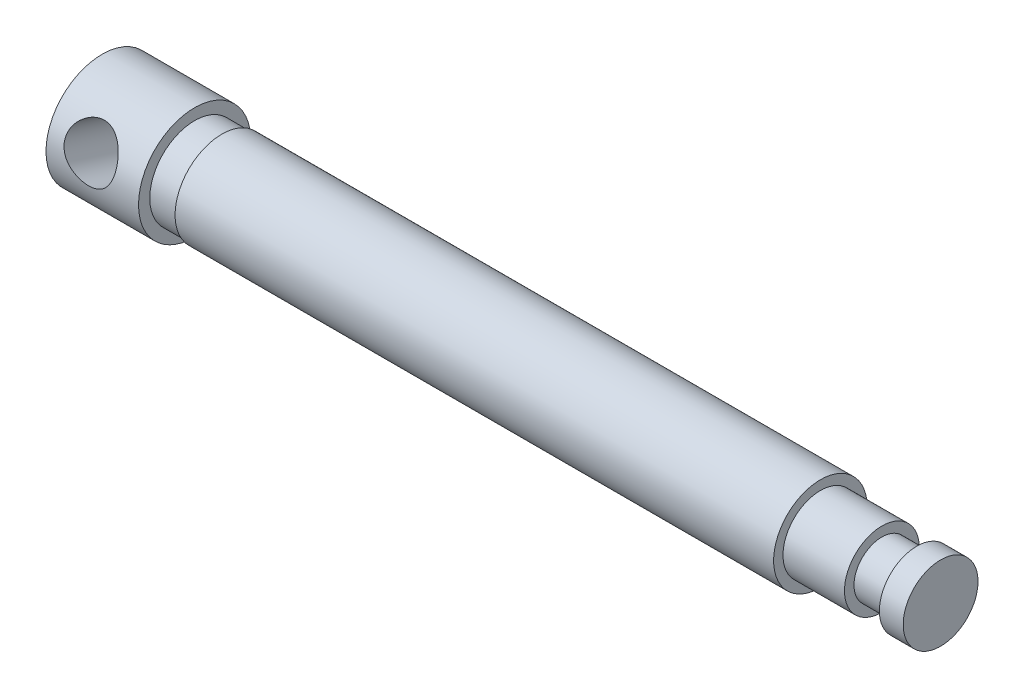
ISO-10303-21;
HEADER;
FILE_DESCRIPTION(('STEP AP214'),'2;1');
FILE_NAME('part.step','',(''),(''),'','','');
FILE_SCHEMA(('AUTOMOTIVE_DESIGN { 1 0 10303 214 1 1 1 1 }'));
ENDSEC;
DATA;
#1=APPLICATION_CONTEXT('core data for automotive mechanical design processes');
#2=APPLICATION_PROTOCOL_DEFINITION('international standard','automotive_design',2000,#1);
#3=PRODUCT_CONTEXT('',#1,'mechanical');
#4=PRODUCT('Part','Part','',(#3));
#5=PRODUCT_RELATED_PRODUCT_CATEGORY('part','',(#4));
#6=PRODUCT_DEFINITION_FORMATION('','',#4);
#7=PRODUCT_DEFINITION_CONTEXT('part definition',#1,'design');
#8=PRODUCT_DEFINITION('design','',#6,#7);
#9=PRODUCT_DEFINITION_SHAPE('','',#8);
#10=(LENGTH_UNIT() NAMED_UNIT(*) SI_UNIT(.MILLI.,.METRE.));
#11=(NAMED_UNIT(*) PLANE_ANGLE_UNIT() SI_UNIT($,.RADIAN.));
#12=(NAMED_UNIT(*) SI_UNIT($,.STERADIAN.) SOLID_ANGLE_UNIT());
#13=UNCERTAINTY_MEASURE_WITH_UNIT(LENGTH_MEASURE(1.E-05),#10,'distance_accuracy_value','');
#14=(GEOMETRIC_REPRESENTATION_CONTEXT(3) GLOBAL_UNCERTAINTY_ASSIGNED_CONTEXT((#13)) GLOBAL_UNIT_ASSIGNED_CONTEXT((#10,
#11,#12)) REPRESENTATION_CONTEXT('',''));
#15=CARTESIAN_POINT('',(0.,0.,0.));
#16=DIRECTION('',(0.,0.,1.));
#17=DIRECTION('',(1.,0.,0.));
#18=AXIS2_PLACEMENT_3D('',#15,#16,#17);
#19=CARTESIAN_POINT('',(0.,-9.525,0.));
#20=DIRECTION('',(-1.,0.,0.));
#21=DIRECTION('',(0.,0.,1.));
#22=AXIS2_PLACEMENT_3D('',#19,#20,#21);
#23=PLANE('',#22);
#24=CARTESIAN_POINT('',(0.,0.,0.));
#25=DIRECTION('',(-1.,0.,0.));
#26=DIRECTION('',(0.,0.,1.));
#27=AXIS2_PLACEMENT_3D('',#24,#25,#26);
#28=CIRCLE('',#27,9.525);
#29=CARTESIAN_POINT('',(0.,0.,9.525));
#30=VERTEX_POINT('',#29);
#31=EDGE_CURVE('E121',#30,#30,#28,.T.);
#32=ORIENTED_EDGE('',*,*,#31,.T.);
#33=EDGE_LOOP('',(#32));
#34=FACE_BOUND('',#33,.T.);
#35=ADVANCED_FACE('F34',(#34),#23,.T.);
#36=CARTESIAN_POINT('',(158.75,0.,0.));
#37=DIRECTION('',(-1.,0.,0.));
#38=DIRECTION('',(0.,0.,1.));
#39=AXIS2_PLACEMENT_3D('',#36,#37,#38);
#40=CYLINDRICAL_SURFACE('',#39,7.62);
#41=CARTESIAN_POINT('',(20.32,0.,0.));
#42=DIRECTION('',(1.,0.,0.));
#43=DIRECTION('',(0.,0.,-1.));
#44=AXIS2_PLACEMENT_3D('',#41,#42,#43);
#45=CIRCLE('',#44,7.62);
#46=CARTESIAN_POINT('',(20.32,0.,-7.62));
#47=VERTEX_POINT('',#46);
#48=EDGE_CURVE('E123',#47,#47,#45,.F.);
#49=ORIENTED_EDGE('',*,*,#48,.T.);
#50=EDGE_LOOP('',(#49));
#51=FACE_BOUND('',#50,.T.);
#52=CARTESIAN_POINT('',(15.706148476498,0.,0.));
#53=DIRECTION('',(-1.,0.,0.));
#54=DIRECTION('',(0.,0.,1.));
#55=AXIS2_PLACEMENT_3D('',#52,#53,#54);
#56=CIRCLE('',#55,7.62);
#57=CARTESIAN_POINT('',(15.706148476498,0.,7.62));
#58=VERTEX_POINT('',#57);
#59=EDGE_CURVE('E49',#58,#58,#56,.T.);
#60=ORIENTED_EDGE('',*,*,#59,.F.);
#61=EDGE_LOOP('',(#60));
#62=FACE_BOUND('',#61,.T.);
#63=ADVANCED_FACE('F113',(#51,#62),#40,.T.);
#64=CARTESIAN_POINT('',(15.706148476498,-7.62,0.));
#65=DIRECTION('',(1.,0.,0.));
#66=DIRECTION('',(0.,0.,-1.));
#67=AXIS2_PLACEMENT_3D('',#64,#65,#66);
#68=PLANE('',#67);
#69=ORIENTED_EDGE('',*,*,#59,.T.);
#70=EDGE_LOOP('',(#69));
#71=FACE_BOUND('',#70,.T.);
#72=CARTESIAN_POINT('',(15.706148476498,0.,0.));
#73=DIRECTION('',(-1.,0.,0.));
#74=DIRECTION('',(0.,0.,1.));
#75=AXIS2_PLACEMENT_3D('',#72,#73,#74);
#76=CIRCLE('',#75,9.525);
#77=CARTESIAN_POINT('',(15.706148476498,0.,9.525));
#78=VERTEX_POINT('',#77);
#79=EDGE_CURVE('E54',#78,#78,#76,.T.);
#80=ORIENTED_EDGE('',*,*,#79,.F.);
#81=EDGE_LOOP('',(#80));
#82=FACE_BOUND('',#81,.T.);
#83=ADVANCED_FACE('F108',(#71,#82),#68,.T.);
#84=CARTESIAN_POINT('',(158.75,0.,0.));
#85=DIRECTION('',(-1.,0.,0.));
#86=DIRECTION('',(0.,0.,1.));
#87=AXIS2_PLACEMENT_3D('',#84,#85,#86);
#88=CYLINDRICAL_SURFACE('',#87,9.525);
#89=CARTESIAN_POINT('',(10.3607599364025,0.,9.525));
#90=CARTESIAN_POINT('',(10.5191364986908,0.185736951544377,9.52499527010194));
#91=CARTESIAN_POINT('',(10.6634881100256,0.383787656188102,9.51953580729828));
#92=CARTESIAN_POINT('',(10.9202225751908,0.799140493333997,9.49370118995498));
#93=CARTESIAN_POINT('',(11.0325536247621,1.01647308453263,9.47330205349973));
#94=CARTESIAN_POINT('',(11.2215270013399,1.46476695610562,9.41441744343158));
#95=CARTESIAN_POINT('',(11.2980627242603,1.69576666685899,9.37587862224707));
#96=CARTESIAN_POINT('',(11.4115485665691,2.16320031195492,9.27917093731359));
#97=CARTESIAN_POINT('',(11.4485341294286,2.39962918641392,9.22101971110659));
#98=CARTESIAN_POINT('',(11.4802078036525,2.85563018773093,9.08976839361644));
#99=CARTESIAN_POINT('',(11.4773167636023,3.07535761858014,9.01778394650828));
#100=CARTESIAN_POINT('',(11.4352207425021,3.50589844064426,8.85928428868552));
#101=CARTESIAN_POINT('',(11.3960152774546,3.7167117130124,8.77276888431538));
#102=CARTESIAN_POINT('',(11.2844340807387,4.11865214927032,8.59126292997238));
#103=CARTESIAN_POINT('',(11.2129143037224,4.31014027802157,8.49653913071002));
#104=CARTESIAN_POINT('',(11.0395618250778,4.67548040898246,8.30111311277807));
#105=CARTESIAN_POINT('',(10.9377226644698,4.84932864274974,8.20040962391017));
#106=CARTESIAN_POINT('',(10.6992368440798,5.18730830605299,7.99121078306556));
#107=CARTESIAN_POINT('',(10.5607814643836,5.35010845793332,7.88262880644303));
#108=CARTESIAN_POINT('',(10.2563155827699,5.65096347171958,7.66982812102441));
#109=CARTESIAN_POINT('',(10.0902885329931,5.78900336898937,7.56561207988273));
#110=CARTESIAN_POINT('',(9.72013932054723,6.04858542153344,7.3600082424051));
#111=CARTESIAN_POINT('',(9.51407113644799,6.16804760202666,7.25945172488597));
#112=CARTESIAN_POINT('',(9.18749689916968,6.32312987387547,7.12379058785145));
#113=CARTESIAN_POINT('',(9.07566311958638,6.370824279271,7.08108060158332));
#114=CARTESIAN_POINT('',(8.84678982973563,6.45797729281414,7.00168724534438));
#115=CARTESIAN_POINT('',(8.72975298153788,6.4974400550423,6.96500083758743));
#116=CARTESIAN_POINT('',(8.49396945610535,6.56709705081749,6.89935530396093));
#117=CARTESIAN_POINT('',(8.375323164339,6.59748268601121,6.87023858605383));
#118=CARTESIAN_POINT('',(8.13469897285254,6.64995794812896,6.81945887772287));
#119=CARTESIAN_POINT('',(8.01272275092659,6.67205167311785,6.79779220574905));
#120=CARTESIAN_POINT('',(7.76645821764584,6.70777105149872,6.76254864007625));
#121=CARTESIAN_POINT('',(7.64217140486392,6.72140200890581,6.7489666795283));
#122=CARTESIAN_POINT('',(7.39232504837467,6.74009197359256,6.73030183794226));
#123=CARTESIAN_POINT('',(7.26676563911811,6.74515187710671,6.72521806828936));
#124=CARTESIAN_POINT('',(7.02864799120306,6.74657598364014,6.72378860685507));
#125=CARTESIAN_POINT('',(6.9160983118217,6.74379134142682,6.72658760370679));
#126=CARTESIAN_POINT('',(6.69172764090169,6.73132919250598,6.73905855982816));
#127=CARTESIAN_POINT('',(6.57990689642615,6.7216494600829,6.74873273838461));
#128=CARTESIAN_POINT('',(6.35787527351533,6.6954678926085,6.77470846361995));
#129=CARTESIAN_POINT('',(6.24766396995085,6.67896789413751,6.79100822612341));
#130=CARTESIAN_POINT('',(6.02955518690167,6.63926321491362,6.82982949123942));
#131=CARTESIAN_POINT('',(5.92165862849644,6.61605591647676,6.85235342283169));
#132=CARTESIAN_POINT('',(5.60529694478747,6.5372637026666,6.92785030356844));
#133=CARTESIAN_POINT('',(5.40105990538804,6.47213850481868,6.98913434112505));
#134=CARTESIAN_POINT('',(5.00860463362805,6.31749342333822,7.12921595534312));
#135=CARTESIAN_POINT('',(4.82039213610284,6.22796485402805,7.20801976581874));
#136=CARTESIAN_POINT('',(4.44545373734529,6.01564457452885,7.3863865544388));
#137=CARTESIAN_POINT('',(4.26069740500449,5.89044626800522,7.48722933588467));
#138=CARTESIAN_POINT('',(3.91775821227732,5.6131559735438,7.69729026126686));
#139=CARTESIAN_POINT('',(3.75958849732245,5.46105075764552,7.80651250968683));
#140=CARTESIAN_POINT('',(3.54075166246218,5.2090919882868,7.97509277438609));
#141=CARTESIAN_POINT('',(3.46912376316846,5.11814829209079,8.03383651109911));
#142=CARTESIAN_POINT('',(3.33499351547364,4.9295428118569,8.15092185901507));
#143=CARTESIAN_POINT('',(3.2724874803552,4.83188376552255,8.20926362354576));
#144=CARTESIAN_POINT('',(3.15715203819268,4.63027063224375,8.32464499366092));
#145=CARTESIAN_POINT('',(3.10432341580406,4.52631603575751,8.38168449332836));
#146=CARTESIAN_POINT('',(3.00891522833457,4.31273662979614,8.49355322312598));
#147=CARTESIAN_POINT('',(2.96633030805965,4.20311481959882,8.54838359560559));
#148=CARTESIAN_POINT('',(2.89388879110688,3.98494179912969,8.65214760559187));
#149=CARTESIAN_POINT('',(2.86346857232699,3.87665305715597,8.70123977979387));
#150=CARTESIAN_POINT('',(2.81257571525813,3.65638757911034,8.79606854974607));
#151=CARTESIAN_POINT('',(2.79209842516826,3.54441259388205,8.84180670615427));
#152=CARTESIAN_POINT('',(2.76132811337706,3.31760479541081,8.92938395063869));
#153=CARTESIAN_POINT('',(2.75103263409749,3.2027726786555,8.97122397739482));
#154=CARTESIAN_POINT('',(2.74075071445813,2.97116784353084,9.05056723293867));
#155=CARTESIAN_POINT('',(2.74076368568873,2.85439523630576,9.08807070913584));
#156=CARTESIAN_POINT('',(2.75069362394716,2.62903273687757,9.15568458758891));
#157=CARTESIAN_POINT('',(2.75984063654251,2.52051237554944,9.18614306531362));
#158=CARTESIAN_POINT('',(2.78680204263107,2.30343925505238,9.24296409341107));
#159=CARTESIAN_POINT('',(2.80461926558988,2.19488649687649,9.26932530295959));
#160=CARTESIAN_POINT('',(2.84873064078999,1.97861549685798,9.31788484591951));
#161=CARTESIAN_POINT('',(2.87502175458566,1.87089697004438,9.34008466695582));
#162=CARTESIAN_POINT('',(2.93581624080212,1.65700962673866,9.38039543016257));
#163=CARTESIAN_POINT('',(2.97032275451687,1.55084141955794,9.39850480310834));
#164=CARTESIAN_POINT('',(3.08624217763544,1.23435876467868,9.44709361989633));
#165=CARTESIAN_POINT('',(3.17977890176946,1.0274079451661,9.47153881017203));
#166=CARTESIAN_POINT('',(3.39595107460002,0.628187770902369,9.50638264949276));
#167=CARTESIAN_POINT('',(3.51859625042481,0.435923352334654,9.51677659526302));
#168=CARTESIAN_POINT('',(3.80087116182484,0.0557674020491262,9.52688250617847));
#169=CARTESIAN_POINT('',(3.96268119367101,-0.130530670377653,9.52566878412402));
#170=CARTESIAN_POINT('',(4.31326259804997,-0.475832360298347,9.51467848072312));
#171=CARTESIAN_POINT('',(4.5020499721636,-0.634819654298398,9.50489679951021));
#172=CARTESIAN_POINT('',(4.80778241025368,-0.852624073065118,9.48706331233395));
#173=CARTESIAN_POINT('',(4.91654042675479,-0.923283941067487,9.48037687426898));
#174=CARTESIAN_POINT('',(5.13981388642196,-1.05475657697705,9.46665074788829));
#175=CARTESIAN_POINT('',(5.25432682873485,-1.1155735745193,9.45961121301638));
#176=CARTESIAN_POINT('',(5.48839116359502,-1.22658872941779,9.44585825394908));
#177=CARTESIAN_POINT('',(5.60794184910525,-1.2767883709851,9.43914478427393));
#178=CARTESIAN_POINT('',(5.85119400439354,-1.36581816062955,9.42667432655738));
#179=CARTESIAN_POINT('',(5.97489309769903,-1.40465469827367,9.4209168017712));
#180=CARTESIAN_POINT('',(6.21743073454272,-1.46822260990757,9.41121214018112));
#181=CARTESIAN_POINT('',(6.33606991971395,-1.49370075498979,9.40717235542773));
#182=CARTESIAN_POINT('',(6.57517016061681,-1.53373513987291,9.40072842877159));
#183=CARTESIAN_POINT('',(6.69563029767528,-1.5482967110718,9.39832348850282));
#184=CARTESIAN_POINT('',(6.93735791982056,-1.56625785162575,9.3953469852333));
#185=CARTESIAN_POINT('',(7.0586250777104,-1.56966169776488,9.39477471976563));
#186=CARTESIAN_POINT('',(7.30094385470936,-1.56525839021776,9.3955093666478));
#187=CARTESIAN_POINT('',(7.4219954861345,-1.55745189915842,9.39681616792871));
#188=CARTESIAN_POINT('',(7.65182737236076,-1.53198764075611,9.40099927297783));
#189=CARTESIAN_POINT('',(7.76071831492668,-1.51529510092216,9.40372127046903));
#190=CARTESIAN_POINT('',(7.97673031448197,-1.47301655522465,9.41043545904468));
#191=CARTESIAN_POINT('',(8.08385078188616,-1.44742764689547,9.41442806463262));
#192=CARTESIAN_POINT('',(8.40156224599921,-1.35776206418409,9.42792837579802));
#193=CARTESIAN_POINT('',(8.60857901237537,-1.28077786509333,9.43896026326298));
#194=CARTESIAN_POINT('',(9.01520010929574,-1.09268276574515,9.46260557143946));
#195=CARTESIAN_POINT('',(9.21427417920468,-0.980449343374874,9.47526145697541));
#196=CARTESIAN_POINT('',(9.59305114459453,-0.727237181014353,9.49804365709395));
#197=CARTESIAN_POINT('',(9.77277976218093,-0.58629734969924,9.50817335476516));
#198=CARTESIAN_POINT('',(10.0156916730228,-0.365526097252751,9.5182250512842));
#199=CARTESIAN_POINT('',(10.0879161903266,-0.29551415400242,9.52068852964737));
#200=CARTESIAN_POINT('',(10.2278084293631,-0.151032525435843,9.52407705226857));
#201=CARTESIAN_POINT('',(10.2954757156259,-0.0765624153965945,9.52500194970585));
#202=CARTESIAN_POINT('',(10.3607599364025,0.,9.525));
#203=B_SPLINE_CURVE_WITH_KNOTS('',3,(#89,#90,#91,#92,#93,#94,#95,#96,#97,#98,#99,#100,#101,#102,
#103,#104,#105,#106,#107,#108,#109,#110,#111,#112,#113,#114,#115,#116,#117,#118,#119,#120,#121,
#122,#123,#124,#125,#126,#127,#128,#129,#130,#131,#132,#133,#134,#135,#136,#137,#138,#139,#140,
#141,#142,#143,#144,#145,#146,#147,#148,#149,#150,#151,#152,#153,#154,#155,#156,#157,#158,#159,
#160,#161,#162,#163,#164,#165,#166,#167,#168,#169,#170,#171,#172,#173,#174,#175,#176,#177,#178,
#179,#180,#181,#182,#183,#184,#185,#186,#187,#188,#189,#190,#191,#192,#193,#194,#195,#196,#197,
#198,#199,#200,#201,#202),.UNSPECIFIED.,.T.,.F.,(4,2,2,2,2,2,2,2,2,2,2,2,2,2,2,2,2,2,2,2,2,2,2,
2,2,2,2,2,2,2,2,2,2,2,2,2,2,2,2,2,2,2,2,2,2,2,2,2,2,2,2,2,2,2,2,2,4),(0.,0.73193177901628,
1.46504107421226,2.20031999516466,2.93493943120138,3.62516820512768,4.31540617853331,
4.98834508710979,5.66142745548398,6.37753064123816,7.09406517871376,7.86560591777974,
8.25178454097482,8.63776780596099,9.01491996803209,9.39188548604923,9.76861450287889,
10.1453041245078,10.4827426192057,10.8202900874805,11.1577467191816,11.495335229644,
12.161188939618,12.827279951209,13.5589300325332,14.2909408120148,14.6799733639347,
15.068848245349,15.4577546432318,15.8464572849317,16.2141474914849,16.5816655079629,
16.9490947951478,17.3165031093544,17.6553513485566,17.994310242867,18.333147733142,
18.6721149922002,19.3542030831227,20.0365194281369,20.7736756599335,21.511270964197,
21.9004592632429,22.2894798753917,22.6784460699549,23.0671931234156,23.4309275948773,
23.7944843110461,24.1579016587066,24.5212975261745,24.851491714948,25.1817937317672,
25.842171865918,26.5261788965328,27.2092649206581,27.510944891858,27.812653649545),.UNSPECIFIED.);
#204=CARTESIAN_POINT('',(10.3607599364025,0.,9.525));
#205=VERTEX_POINT('',#204);
#206=EDGE_CURVE('E10',#205,#205,#203,.T.);
#207=ORIENTED_EDGE('',*,*,#206,.F.);
#208=EDGE_LOOP('',(#207));
#209=FACE_BOUND('',#208,.T.);
#210=CARTESIAN_POINT('',(7.10830419949795,-6.74600128240359,-6.72436552381034));
#211=CARTESIAN_POINT('',(6.99308600795315,-6.74600070795134,-6.72436684785682));
#212=CARTESIAN_POINT('',(6.87784106913534,-6.74237477274111,-6.72800982841945));
#213=CARTESIAN_POINT('',(6.64821383569747,-6.7278965239951,-6.74248723719467));
#214=CARTESIAN_POINT('',(6.53383206487401,-6.71704013152422,-6.75332572461471));
#215=CARTESIAN_POINT('',(6.30662870419325,-6.68815232252926,-6.78193619656994));
#216=CARTESIAN_POINT('',(6.19381044601065,-6.67010747589703,-6.79972115790202));
#217=CARTESIAN_POINT('',(5.97074000652934,-6.62697491101131,-6.84176336513133));
#218=CARTESIAN_POINT('',(5.86048894203736,-6.60188418736433,-6.86602337271698));
#219=CARTESIAN_POINT('',(5.53580408849797,-6.51654812716209,-6.9474054047063));
#220=CARTESIAN_POINT('',(5.32611495042217,-6.44606933524494,-7.01330637609985));
#221=CARTESIAN_POINT('',(4.92451021614179,-6.27918589943418,-7.16309582004389));
#222=CARTESIAN_POINT('',(4.73259298167152,-6.18278364844511,-7.24698263223904));
#223=CARTESIAN_POINT('',(4.35722933376751,-5.9577553194022,-7.43327305836452));
#224=CARTESIAN_POINT('',(4.17527246261756,-5.82736946938708,-7.53655321907915));
#225=CARTESIAN_POINT('',(3.83887080016364,-5.53957685783265,-7.75053385176756));
#226=CARTESIAN_POINT('',(3.68443800008382,-5.38215837752827,-7.86123752912963));
#227=CARTESIAN_POINT('',(3.47261664670678,-5.12270253942803,-8.0308823023998));
#228=CARTESIAN_POINT('',(3.40383557588988,-5.02960939758582,-8.08958452798839));
#229=CARTESIAN_POINT('',(3.27557303727922,-4.83683763002201,-8.2062960273234));
#230=CARTESIAN_POINT('',(3.21608769516181,-4.73716177265468,-8.2643055804048));
#231=CARTESIAN_POINT('',(3.10696703107483,-4.53168832184975,-8.3787385503364));
#232=CARTESIAN_POINT('',(3.05733211091934,-4.42589047891408,-8.43516190240244));
#233=CARTESIAN_POINT('',(2.96846787592103,-4.2088400336867,-8.54553092759587));
#234=CARTESIAN_POINT('',(2.92923305850244,-4.09759035296811,-8.59947789840516));
#235=CARTESIAN_POINT('',(2.86367609540549,-3.87729583757032,-8.70091944096472));
#236=CARTESIAN_POINT('',(2.83671218017715,-3.76853059232902,-8.74860687095307));
#237=CARTESIAN_POINT('',(2.79267112231556,-3.5476304250861,-8.84048884127096));
#238=CARTESIAN_POINT('',(2.7755893721607,-3.4354970991344,-8.88468500107885));
#239=CARTESIAN_POINT('',(2.75150822071768,-3.20869996277899,-8.96908618063951));
#240=CARTESIAN_POINT('',(2.74450673185222,-3.09403668131341,-9.00929202516255));
#241=CARTESIAN_POINT('',(2.74066944430504,-2.86310099538295,-9.08532072839287));
#242=CARTESIAN_POINT('',(2.74383314791965,-2.7468286699769,-9.12114380159833));
#243=CARTESIAN_POINT('',(2.75967656254285,-2.52226071764074,-9.18566575338383));
#244=CARTESIAN_POINT('',(2.77163810244702,-2.41400844868048,-9.21469504189839));
#245=CARTESIAN_POINT('',(2.80412095457292,-2.19773163796138,-9.26865837071368));
#246=CARTESIAN_POINT('',(2.82464506247659,-2.08970718217188,-9.29359106976701));
#247=CARTESIAN_POINT('',(2.87403772202958,-1.87473504756537,-9.33932866431435));
#248=CARTESIAN_POINT('',(2.90290347653087,-1.76778702021649,-9.36013493955693));
#249=CARTESIAN_POINT('',(2.96869935057316,-1.55566500290207,-9.39772119251539));
#250=CARTESIAN_POINT('',(3.0056325581491,-1.45049170891579,-9.41449962328906));
#251=CARTESIAN_POINT('',(3.12926957393406,-1.13566840202367,-9.45944485152564));
#252=CARTESIAN_POINT('',(3.22810539158685,-0.929769230631336,-9.48158617149435));
#253=CARTESIAN_POINT('',(3.45464233479054,-0.533558619287505,-9.51212783383045));
#254=CARTESIAN_POINT('',(3.58235404247901,-0.34325292879436,-9.5205231293778));
#255=CARTESIAN_POINT('',(3.87522488247077,0.0323290966621897,-9.52694505339596));
#256=CARTESIAN_POINT('',(4.04260671208067,0.21588961835091,-9.52405731327188));
#257=CARTESIAN_POINT('',(4.40411297288658,0.554516196221068,-9.51035822776073));
#258=CARTESIAN_POINT('',(4.59825229204548,0.709566276199253,-9.4995424566196));
#259=CARTESIAN_POINT('',(4.91110121389023,0.919830587392728,-9.48076031162254));
#260=CARTESIAN_POINT('',(5.02172134592678,0.987433127174057,-9.47388867530245));
#261=CARTESIAN_POINT('',(5.24849850929665,1.11255187394269,-9.46001116071151));
#262=CARTESIAN_POINT('',(5.36465305155669,1.17007256173886,-9.45300534361996));
#263=CARTESIAN_POINT('',(5.60173109293689,1.2742571472852,-9.43952630968963));
#264=CARTESIAN_POINT('',(5.72265339070499,1.32092375979481,-9.43305295993552));
#265=CARTESIAN_POINT('',(5.96834542922685,1.40268031234116,-9.42124312511457));
#266=CARTESIAN_POINT('',(6.09311293410028,1.4377768461842,-9.41590599313193));
#267=CARTESIAN_POINT('',(6.33629953511899,1.49369575586944,-9.40719080408681));
#268=CARTESIAN_POINT('',(6.45451841023217,1.51537216516192,-9.40369829872231));
#269=CARTESIAN_POINT('',(6.69242224247601,1.54791298398814,-9.39839690635225));
#270=CARTESIAN_POINT('',(6.81210646424929,1.5587826083433,-9.39658720733465));
#271=CARTESIAN_POINT('',(7.05195734892959,1.56953569146634,-9.3947971114146));
#272=CARTESIAN_POINT('',(7.17212390863974,1.56942138678597,-9.39481634210479));
#273=CARTESIAN_POINT('',(7.41192401972313,1.55821496542328,-9.39668149212233));
#274=CARTESIAN_POINT('',(7.53155759493826,1.54712334484195,-9.39852732889934));
#275=CARTESIAN_POINT('',(7.75919105533655,1.51555531111388,-9.40366674295893));
#276=CARTESIAN_POINT('',(7.86731643580954,1.49595546603788,-9.40682412560228));
#277=CARTESIAN_POINT('',(8.08157734622832,1.44800347357465,-9.41432370759939));
#278=CARTESIAN_POINT('',(8.18771222486559,1.41964851266976,-9.4186662877725));
#279=CARTESIAN_POINT('',(8.50209015383999,1.32196668191694,-9.43304961715472));
#280=CARTESIAN_POINT('',(8.70646916957355,1.23999965302428,-9.44445036282467));
#281=CARTESIAN_POINT('',(9.10916097731305,1.04157535054483,-9.46842696827837));
#282=CARTESIAN_POINT('',(9.30677212296834,0.923715707183932,-9.48103270727961));
#283=CARTESIAN_POINT('',(9.68210153826814,0.659390120835959,-9.50307316887547));
#284=CARTESIAN_POINT('',(9.85981007467188,0.512910276600528,-9.51250634442635));
#285=CARTESIAN_POINT('',(10.2092092261728,0.179295586161389,-9.52492028356895));
#286=CARTESIAN_POINT('',(10.3784239123403,-0.0104654448432242,-9.52714214081136));
#287=CARTESIAN_POINT('',(10.6849122427684,-0.41424015314601,-9.5181230217378));
#288=CARTESIAN_POINT('',(10.8221800468353,-0.628258254250213,-9.50687958614359));
#289=CARTESIAN_POINT('',(11.0015389462087,-0.963850028892633,-9.4767896306167));
#290=CARTESIAN_POINT('',(11.057179208191,-1.07895197499378,-9.46442885523476));
#291=CARTESIAN_POINT('',(11.158625682105,-1.31278827470229,-9.43483246917913));
#292=CARTESIAN_POINT('',(11.2044362327246,-1.43152099918904,-9.41759901704945));
#293=CARTESIAN_POINT('',(11.2857104914666,-1.67158476231116,-9.37796521137542));
#294=CARTESIAN_POINT('',(11.3211780251792,-1.79291482239631,-9.35556677371682));
#295=CARTESIAN_POINT('',(11.3813586485173,-2.03713262252842,-9.30544168165349));
#296=CARTESIAN_POINT('',(11.4060727645824,-2.1600202127525,-9.27771553615569));
#297=CARTESIAN_POINT('',(11.442857265264,-2.39616026995551,-9.21941465327588));
#298=CARTESIAN_POINT('',(11.4557942692967,-2.5093813719387,-9.18925650756145));
#299=CARTESIAN_POINT('',(11.4721755421371,-2.73530300795741,-9.12455756146353));
#300=CARTESIAN_POINT('',(11.4756166384846,-2.84800335546491,-9.09001530043408));
#301=CARTESIAN_POINT('',(11.4729549471712,-3.07187125496853,-9.01682276150087));
#302=CARTESIAN_POINT('',(11.4668579295732,-3.18303969265555,-8.97817498040425));
#303=CARTESIAN_POINT('',(11.4452009250487,-3.40309570846628,-8.89709621981472));
#304=CARTESIAN_POINT('',(11.4296374338333,-3.51198242649735,-8.85466384431097));
#305=CARTESIAN_POINT('',(11.3902298776118,-3.721297906653,-8.76867832936301));
#306=CARTESIAN_POINT('',(11.3668366291675,-3.82187786895783,-8.72528615414666));
#307=CARTESIAN_POINT('',(11.3119034008978,-4.01964297059219,-8.63596526795097));
#308=CARTESIAN_POINT('',(11.2803605993989,-4.11682692084105,-8.59003568276633));
#309=CARTESIAN_POINT('',(11.1739329521849,-4.40241541675671,-8.44921616081937));
#310=CARTESIAN_POINT('',(11.0872155042932,-4.58503108321495,-8.35122290931708));
#311=CARTESIAN_POINT('',(10.8804825309271,-4.93912091248659,-8.14705343541905));
#312=CARTESIAN_POINT('',(10.7591278497598,-5.10970611598683,-8.04070786505823));
#313=CARTESIAN_POINT('',(10.4883201943115,-5.42795901838311,-7.82939338043567));
#314=CARTESIAN_POINT('',(10.3388548129265,-5.57561654504808,-7.72442509602928));
#315=CARTESIAN_POINT('',(10.0014100248687,-5.85786319807381,-7.51297121669885));
#316=CARTESIAN_POINT('',(9.81124794681271,-5.99030669975469,-7.40710138143053));
#317=CARTESIAN_POINT('',(9.40541110939189,-6.22499124366116,-7.21100370281147));
#318=CARTESIAN_POINT('',(9.18971929755323,-6.32721193745081,-7.12078641483013));
#319=CARTESIAN_POINT('',(8.84995608318797,-6.45686129625836,-7.00271552601443));
#320=CARTESIAN_POINT('',(8.73332479865861,-6.49627786784705,-6.96608465252835));
#321=CARTESIAN_POINT('',(8.49566050574551,-6.56670083039085,-6.89973979214956));
#322=CARTESIAN_POINT('',(8.37462975901053,-6.59771147516592,-6.87002230781921));
#323=CARTESIAN_POINT('',(8.12938871160711,-6.65103662838112,-6.81840980423598));
#324=CARTESIAN_POINT('',(8.0051876545897,-6.67337389210248,-6.79649432856423));
#325=CARTESIAN_POINT('',(7.7544050446142,-6.70927161587257,-6.76106073165156));
#326=CARTESIAN_POINT('',(7.6278253208708,-6.72283855728025,-6.74753640955928));
#327=CARTESIAN_POINT('',(7.43547700368195,-6.7366393047728,-6.73374725900756));
#328=CARTESIAN_POINT('',(7.37014689039849,-6.74014874833118,-6.73023256539173));
#329=CARTESIAN_POINT('',(7.23931547119943,-6.74482994598256,-6.72554127584964));
#330=CARTESIAN_POINT('',(7.1738141587153,-6.74600160902166,-6.72436477099319));
#331=CARTESIAN_POINT('',(7.10830419949795,-6.74600128240359,-6.72436552381034));
#332=B_SPLINE_CURVE_WITH_KNOTS('',3,(#210,#211,#212,#213,#214,#215,#216,#217,#218,#219,#220,
#221,#222,#223,#224,#225,#226,#227,#228,#229,#230,#231,#232,#233,#234,#235,#236,#237,#238,#239,
#240,#241,#242,#243,#244,#245,#246,#247,#248,#249,#250,#251,#252,#253,#254,#255,#256,#257,#258,
#259,#260,#261,#262,#263,#264,#265,#266,#267,#268,#269,#270,#271,#272,#273,#274,#275,#276,#277,
#278,#279,#280,#281,#282,#283,#284,#285,#286,#287,#288,#289,#290,#291,#292,#293,#294,#295,#296,
#297,#298,#299,#300,#301,#302,#303,#304,#305,#306,#307,#308,#309,#310,#311,#312,#313,#314,#315,
#316,#317,#318,#319,#320,#321,#322,#323,#324,#325,#326,#327,#328,#329,#330,#331),.UNSPECIFIED.,
.T.,.F.,(4,2,2,2,2,2,2,2,2,2,2,2,2,2,2,2,2,2,2,2,2,2,2,2,2,2,2,2,2,2,2,2,2,2,2,2,2,2,2,2,2,2,2,
2,2,2,2,2,2,2,2,2,2,2,2,2,2,2,2,2,4),(0.,0.345586559209786,0.691368240311515,1.03779899417164,
1.38437774186571,2.07354776468692,2.7626541944389,3.49913796694012,4.23594181813024,
4.62486530911218,5.01362626764088,5.40240308107754,5.79097378469459,6.15583740360394,
6.52053076886178,6.8851485968757,7.24974857290427,7.58749005501012,7.92534189625505,
8.26308057912084,8.60094876781773,9.28616798854803,9.97163872951242,10.7137665313346,
11.4563089353359,11.845355644512,12.2342290037057,12.6230049952669,13.0115590381944,
13.3717889891192,13.7318450263444,14.0918277489792,14.4517942035541,14.7812042766205,
15.1107203182845,15.769265120843,16.4578408724666,17.1467519105287,17.9061470692787,
18.6656809438264,19.0505728978136,19.4352946151745,19.8198738538114,20.2044163753755,
20.5576047253651,20.9109110567496,21.264003738811,21.6172272079513,21.9528656851512,
22.2886205287655,22.9595613722794,23.6611256663585,24.3630003367536,25.1239437390095,
25.8853983092269,26.2702933373423,26.6549932241214,27.0386768894239,27.4220766833969,
27.6185602366487,27.815051442563),.UNSPECIFIED.);
#333=CARTESIAN_POINT('',(7.10830419949795,-6.74600128240359,-6.72436552381034));
#334=VERTEX_POINT('',#333);
#335=EDGE_CURVE('E57',#334,#334,#332,.T.);
#336=ORIENTED_EDGE('',*,*,#335,.F.);
#337=EDGE_LOOP('',(#336));
#338=FACE_BOUND('',#337,.T.);
#339=ORIENTED_EDGE('',*,*,#79,.T.);
#340=EDGE_LOOP('',(#339));
#341=FACE_BOUND('',#340,.T.);
#342=ORIENTED_EDGE('',*,*,#31,.F.);
#343=EDGE_LOOP('',(#342));
#344=FACE_BOUND('',#343,.T.);
#345=ADVANCED_FACE('F63',(#209,#338,#341,#344),#88,.T.);
#346=CARTESIAN_POINT('',(121.92,0.,0.));
#347=DIRECTION('',(-1.,0.,0.));
#348=DIRECTION('',(0.,0.,1.));
#349=AXIS2_PLACEMENT_3D('',#346,#347,#348);
#350=CYLINDRICAL_SURFACE('',#349,7.9375);
#351=CARTESIAN_POINT('',(121.92,0.,0.));
#352=DIRECTION('',(1.,0.,0.));
#353=DIRECTION('',(0.,0.,-1.));
#354=AXIS2_PLACEMENT_3D('',#351,#352,#353);
#355=CIRCLE('',#354,7.9375);
#356=CARTESIAN_POINT('',(121.92,0.,-7.9375));
#357=VERTEX_POINT('',#356);
#358=EDGE_CURVE('E127',#357,#357,#355,.T.);
#359=ORIENTED_EDGE('',*,*,#358,.F.);
#360=EDGE_LOOP('',(#359));
#361=FACE_BOUND('',#360,.T.);
#362=CARTESIAN_POINT('',(20.32,0.,0.));
#363=DIRECTION('',(1.,0.,0.));
#364=DIRECTION('',(0.,0.,-1.));
#365=AXIS2_PLACEMENT_3D('',#362,#363,#364);
#366=CIRCLE('',#365,7.9375);
#367=CARTESIAN_POINT('',(20.32,0.,-7.9375));
#368=VERTEX_POINT('',#367);
#369=EDGE_CURVE('E130',#368,#368,#366,.T.);
#370=ORIENTED_EDGE('',*,*,#369,.T.);
#371=EDGE_LOOP('',(#370));
#372=FACE_BOUND('',#371,.T.);
#373=ADVANCED_FACE('F99',(#361,#372),#350,.T.);
#374=CARTESIAN_POINT('',(121.92,0.,0.));
#375=DIRECTION('',(1.,0.,0.));
#376=DIRECTION('',(0.,0.,-1.));
#377=AXIS2_PLACEMENT_3D('',#374,#375,#376);
#378=PLANE('',#377);
#379=CARTESIAN_POINT('',(121.92,0.,0.));
#380=DIRECTION('',(1.,0.,0.));
#381=DIRECTION('',(0.,0.,-1.));
#382=AXIS2_PLACEMENT_3D('',#379,#380,#381);
#383=CIRCLE('',#382,6.35);
#384=CARTESIAN_POINT('',(121.92,0.,-6.35));
#385=VERTEX_POINT('',#384);
#386=EDGE_CURVE('E45',#385,#385,#383,.T.);
#387=ORIENTED_EDGE('',*,*,#386,.F.);
#388=EDGE_LOOP('',(#387));
#389=FACE_BOUND('',#388,.T.);
#390=ORIENTED_EDGE('',*,*,#358,.T.);
#391=EDGE_LOOP('',(#390));
#392=FACE_BOUND('',#391,.T.);
#393=ADVANCED_FACE('F96',(#389,#392),#378,.T.);
#394=CARTESIAN_POINT('',(20.32,0.,0.));
#395=DIRECTION('',(1.,0.,0.));
#396=DIRECTION('',(0.,0.,-1.));
#397=AXIS2_PLACEMENT_3D('',#394,#395,#396);
#398=PLANE('',#397);
#399=ORIENTED_EDGE('',*,*,#48,.F.);
#400=EDGE_LOOP('',(#399));
#401=FACE_BOUND('',#400,.T.);
#402=ORIENTED_EDGE('',*,*,#369,.F.);
#403=EDGE_LOOP('',(#402));
#404=FACE_BOUND('',#403,.T.);
#405=ADVANCED_FACE('F95',(#401,#404),#398,.F.);
#406=CARTESIAN_POINT('',(142.322278982709,0.,0.));
#407=DIRECTION('',(1.,0.,0.));
#408=DIRECTION('',(0.,0.,-1.));
#409=AXIS2_PLACEMENT_3D('',#406,#407,#408);
#410=CYLINDRICAL_SURFACE('',#409,6.35);
#411=ORIENTED_EDGE('',*,*,#386,.T.);
#412=EDGE_LOOP('',(#411));
#413=FACE_BOUND('',#412,.T.);
#414=CARTESIAN_POINT('',(132.354619201478,0.,0.));
#415=DIRECTION('',(1.,0.,0.));
#416=DIRECTION('',(0.,0.,-1.));
#417=AXIS2_PLACEMENT_3D('',#414,#415,#416);
#418=CIRCLE('',#417,6.35);
#419=CARTESIAN_POINT('',(132.354619201478,0.,-6.35));
#420=VERTEX_POINT('',#419);
#421=EDGE_CURVE('E133',#420,#420,#418,.T.);
#422=ORIENTED_EDGE('',*,*,#421,.F.);
#423=EDGE_LOOP('',(#422));
#424=FACE_BOUND('',#423,.T.);
#425=ADVANCED_FACE('F91',(#413,#424),#410,.T.);
#426=CARTESIAN_POINT('',(132.354619201478,6.35,0.));
#427=DIRECTION('',(1.,0.,0.));
#428=DIRECTION('',(0.,0.,-1.));
#429=AXIS2_PLACEMENT_3D('',#426,#427,#428);
#430=PLANE('',#429);
#431=ORIENTED_EDGE('',*,*,#421,.T.);
#432=EDGE_LOOP('',(#431));
#433=FACE_BOUND('',#432,.T.);
#434=CARTESIAN_POINT('',(132.354619201478,0.,0.));
#435=DIRECTION('',(1.,0.,0.));
#436=DIRECTION('',(0.,0.,-1.));
#437=AXIS2_PLACEMENT_3D('',#434,#435,#436);
#438=CIRCLE('',#437,4.73362273817885);
#439=CARTESIAN_POINT('',(132.354619201478,0.,-4.73362273817885));
#440=VERTEX_POINT('',#439);
#441=EDGE_CURVE('E138',#440,#440,#438,.T.);
#442=ORIENTED_EDGE('',*,*,#441,.F.);
#443=EDGE_LOOP('',(#442));
#444=FACE_BOUND('',#443,.T.);
#445=ADVANCED_FACE('F87',(#433,#444),#430,.T.);
#446=CARTESIAN_POINT('',(142.322278982709,0.,0.));
#447=DIRECTION('',(1.,0.,0.));
#448=DIRECTION('',(0.,0.,-1.));
#449=AXIS2_PLACEMENT_3D('',#446,#447,#448);
#450=CYLINDRICAL_SURFACE('',#449,4.73362273817885);
#451=ORIENTED_EDGE('',*,*,#441,.T.);
#452=EDGE_LOOP('',(#451));
#453=FACE_BOUND('',#452,.T.);
#454=CARTESIAN_POINT('',(138.281335828156,0.,0.));
#455=DIRECTION('',(1.,0.,0.));
#456=DIRECTION('',(0.,0.,-1.));
#457=AXIS2_PLACEMENT_3D('',#454,#455,#456);
#458=CIRCLE('',#457,4.73362273817885);
#459=CARTESIAN_POINT('',(138.281335828156,0.,-4.73362273817885));
#460=VERTEX_POINT('',#459);
#461=EDGE_CURVE('E141',#460,#460,#458,.T.);
#462=ORIENTED_EDGE('',*,*,#461,.F.);
#463=EDGE_LOOP('',(#462));
#464=FACE_BOUND('',#463,.T.);
#465=ADVANCED_FACE('F83',(#453,#464),#450,.T.);
#466=CARTESIAN_POINT('',(138.281335828156,4.73362273817885,0.));
#467=DIRECTION('',(-1.,0.,0.));
#468=DIRECTION('',(0.,0.,1.));
#469=AXIS2_PLACEMENT_3D('',#466,#467,#468);
#470=PLANE('',#469);
#471=ORIENTED_EDGE('',*,*,#461,.T.);
#472=EDGE_LOOP('',(#471));
#473=FACE_BOUND('',#472,.T.);
#474=CARTESIAN_POINT('',(138.281335828156,0.,0.));
#475=DIRECTION('',(1.,0.,0.));
#476=DIRECTION('',(0.,0.,-1.));
#477=AXIS2_PLACEMENT_3D('',#474,#475,#476);
#478=CIRCLE('',#477,6.34999999999999);
#479=CARTESIAN_POINT('',(138.281335828156,0.,-6.34999999999999));
#480=VERTEX_POINT('',#479);
#481=EDGE_CURVE('E144',#480,#480,#478,.T.);
#482=ORIENTED_EDGE('',*,*,#481,.F.);
#483=EDGE_LOOP('',(#482));
#484=FACE_BOUND('',#483,.T.);
#485=ADVANCED_FACE('F79',(#473,#484),#470,.T.);
#486=CARTESIAN_POINT('',(142.322278982709,0.,0.));
#487=DIRECTION('',(1.,0.,0.));
#488=DIRECTION('',(0.,0.,-1.));
#489=AXIS2_PLACEMENT_3D('',#486,#487,#488);
#490=CYLINDRICAL_SURFACE('',#489,6.34999999999999);
#491=ORIENTED_EDGE('',*,*,#481,.T.);
#492=EDGE_LOOP('',(#491));
#493=FACE_BOUND('',#492,.T.);
#494=CARTESIAN_POINT('',(142.322278982709,0.,0.));
#495=DIRECTION('',(1.,0.,0.));
#496=DIRECTION('',(0.,0.,-1.));
#497=AXIS2_PLACEMENT_3D('',#494,#495,#496);
#498=CIRCLE('',#497,6.34999999999999);
#499=CARTESIAN_POINT('',(142.322278982709,0.,-6.34999999999999));
#500=VERTEX_POINT('',#499);
#501=EDGE_CURVE('E62',#500,#500,#498,.T.);
#502=ORIENTED_EDGE('',*,*,#501,.F.);
#503=EDGE_LOOP('',(#502));
#504=FACE_BOUND('',#503,.T.);
#505=ADVANCED_FACE('F75',(#493,#504),#490,.T.);
#506=CARTESIAN_POINT('',(142.322278982709,6.34999999999999,0.));
#507=DIRECTION('',(1.,0.,0.));
#508=DIRECTION('',(0.,0.,-1.));
#509=AXIS2_PLACEMENT_3D('',#506,#507,#508);
#510=PLANE('',#509);
#511=ORIENTED_EDGE('',*,*,#501,.T.);
#512=EDGE_LOOP('',(#511));
#513=FACE_BOUND('',#512,.T.);
#514=ADVANCED_FACE('F71',(#513),#510,.T.);
#515=CARTESIAN_POINT('',(7.10830419949795,2.91303245211524,9.06861990232932));
#516=DIRECTION('',(0.,0.305830178699763,0.952086078984706));
#517=DIRECTION('',(0.,-0.952086078984706,0.305830178699763));
#518=AXIS2_PLACEMENT_3D('',#515,#516,#517);
#519=CYLINDRICAL_SURFACE('',#518,4.36625999999999);
#520=ORIENTED_EDGE('',*,*,#206,.T.);
#521=EDGE_LOOP('',(#520));
#522=FACE_BOUND('',#521,.T.);
#523=ORIENTED_EDGE('',*,*,#335,.T.);
#524=EDGE_LOOP('',(#523));
#525=FACE_BOUND('',#524,.T.);
#526=ADVANCED_FACE('F67',(#522,#525),#519,.F.);
#527=CLOSED_SHELL('',(#35,#63,#83,#345,#373,#393,#405,#425,#445,#465,#485,#505,#514,#526));
#528=MANIFOLD_SOLID_BREP('B2',#527);
#529=ADVANCED_BREP_SHAPE_REPRESENTATION('',(#18,#528),#14);
#530=SHAPE_DEFINITION_REPRESENTATION(#9,#529);
ENDSEC;
END-ISO-10303-21;
